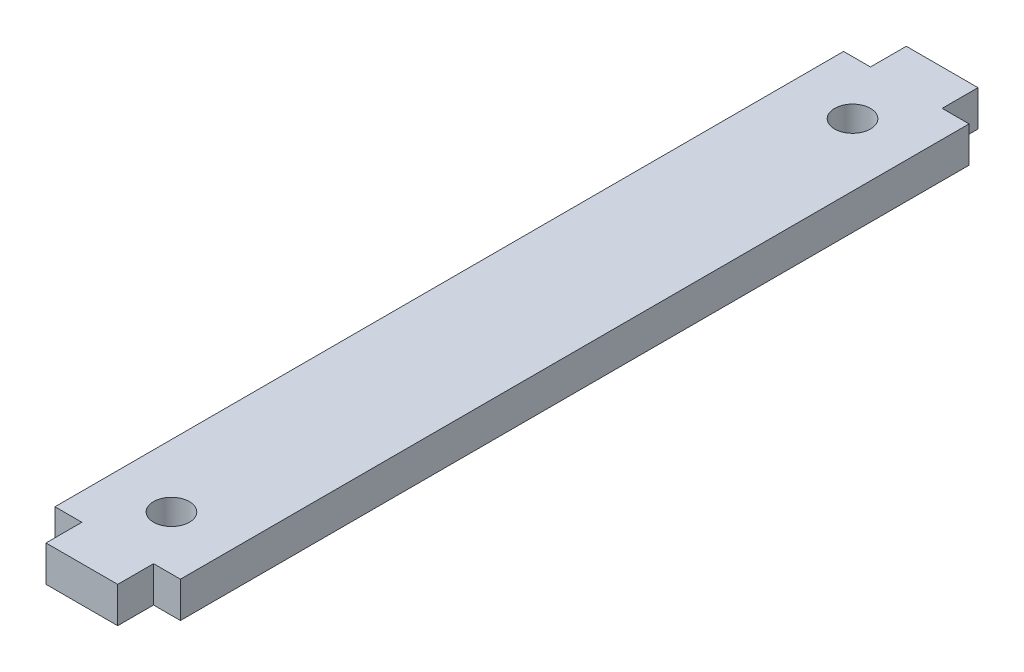
ISO-10303-21;
HEADER;
FILE_DESCRIPTION(('STEP AP214'),'2;1');
FILE_NAME('part.step','',(''),(''),'','','');
FILE_SCHEMA(('AUTOMOTIVE_DESIGN { 1 0 10303 214 1 1 1 1 }'));
ENDSEC;
DATA;
#1=APPLICATION_CONTEXT('core data for automotive mechanical design processes');
#2=APPLICATION_PROTOCOL_DEFINITION('international standard','automotive_design',2000,#1);
#3=PRODUCT_CONTEXT('',#1,'mechanical');
#4=PRODUCT('Part','Part','',(#3));
#5=PRODUCT_RELATED_PRODUCT_CATEGORY('part','',(#4));
#6=PRODUCT_DEFINITION_FORMATION('','',#4);
#7=PRODUCT_DEFINITION_CONTEXT('part definition',#1,'design');
#8=PRODUCT_DEFINITION('design','',#6,#7);
#9=PRODUCT_DEFINITION_SHAPE('','',#8);
#10=(LENGTH_UNIT() NAMED_UNIT(*) SI_UNIT(.MILLI.,.METRE.));
#11=(NAMED_UNIT(*) PLANE_ANGLE_UNIT() SI_UNIT($,.RADIAN.));
#12=(NAMED_UNIT(*) SI_UNIT($,.STERADIAN.) SOLID_ANGLE_UNIT());
#13=UNCERTAINTY_MEASURE_WITH_UNIT(LENGTH_MEASURE(1.E-05),#10,'distance_accuracy_value','');
#14=(GEOMETRIC_REPRESENTATION_CONTEXT(3) GLOBAL_UNCERTAINTY_ASSIGNED_CONTEXT((#13)) GLOBAL_UNIT_ASSIGNED_CONTEXT((#10,
#11,#12)) REPRESENTATION_CONTEXT('',''));
#15=CARTESIAN_POINT('',(0.,0.,0.));
#16=DIRECTION('',(0.,0.,1.));
#17=DIRECTION('',(1.,0.,0.));
#18=AXIS2_PLACEMENT_3D('',#15,#16,#17);
#19=CARTESIAN_POINT('',(0.,5.08,-55.88));
#20=DIRECTION('',(0.,0.,1.));
#21=DIRECTION('',(1.,0.,0.));
#22=AXIS2_PLACEMENT_3D('',#19,#20,#21);
#23=PLANE('',#22);
#24=DIRECTION('',(-1.,0.,0.));
#25=VECTOR('',#24,1.);
#26=CARTESIAN_POINT('',(0.,0.,-55.88));
#27=LINE('',#26,#25);
#28=CARTESIAN_POINT('',(8.89000000000001,0.,-55.88));
#29=VERTEX_POINT('',#28);
#30=CARTESIAN_POINT('',(5.07999999999999,0.,-55.88));
#31=VERTEX_POINT('',#30);
#32=EDGE_CURVE('E219',#29,#31,#27,.T.);
#33=ORIENTED_EDGE('',*,*,#32,.T.);
#34=DIRECTION('',(0.,-1.,0.));
#35=VECTOR('',#34,1.);
#36=CARTESIAN_POINT('',(5.07999999999999,5.08,-55.88));
#37=LINE('',#36,#35);
#38=CARTESIAN_POINT('',(5.07999999999999,5.08,-55.88));
#39=VERTEX_POINT('',#38);
#40=EDGE_CURVE('E11',#39,#31,#37,.T.);
#41=ORIENTED_EDGE('',*,*,#40,.F.);
#42=DIRECTION('',(-1.,0.,0.));
#43=VECTOR('',#42,1.);
#44=CARTESIAN_POINT('',(0.,5.08,-55.88));
#45=LINE('',#44,#43);
#46=CARTESIAN_POINT('',(8.89000000000001,5.08,-55.88));
#47=VERTEX_POINT('',#46);
#48=EDGE_CURVE('E173',#47,#39,#45,.T.);
#49=ORIENTED_EDGE('',*,*,#48,.F.);
#50=DIRECTION('',(0.,-1.,0.));
#51=VECTOR('',#50,1.);
#52=CARTESIAN_POINT('',(8.89000000000001,5.08,-55.88));
#53=LINE('',#52,#51);
#54=EDGE_CURVE('E56',#47,#29,#53,.T.);
#55=ORIENTED_EDGE('',*,*,#54,.T.);
#56=EDGE_LOOP('',(#33,#41,#49,#55));
#57=FACE_BOUND('',#56,.T.);
#58=ADVANCED_FACE('F39',(#57),#23,.F.);
#59=CARTESIAN_POINT('',(5.07999999999999,5.08,0.));
#60=DIRECTION('',(-1.,0.,0.));
#61=DIRECTION('',(0.,0.,1.));
#62=AXIS2_PLACEMENT_3D('',#59,#60,#61);
#63=PLANE('',#62);
#64=DIRECTION('',(0.,0.,-1.));
#65=VECTOR('',#64,1.);
#66=CARTESIAN_POINT('',(5.07999999999999,0.,0.));
#67=LINE('',#66,#65);
#68=CARTESIAN_POINT('',(5.07999999999999,0.,-60.96));
#69=VERTEX_POINT('',#68);
#70=EDGE_CURVE('E217',#31,#69,#67,.T.);
#71=ORIENTED_EDGE('',*,*,#70,.T.);
#72=DIRECTION('',(0.,-1.,0.));
#73=VECTOR('',#72,1.);
#74=CARTESIAN_POINT('',(5.07999999999999,5.08,-60.96));
#75=LINE('',#74,#73);
#76=CARTESIAN_POINT('',(5.07999999999999,5.08,-60.96));
#77=VERTEX_POINT('',#76);
#78=EDGE_CURVE('E48',#77,#69,#75,.T.);
#79=ORIENTED_EDGE('',*,*,#78,.F.);
#80=DIRECTION('',(0.,0.,-1.));
#81=VECTOR('',#80,1.);
#82=CARTESIAN_POINT('',(5.07999999999999,5.08,0.));
#83=LINE('',#82,#81);
#84=EDGE_CURVE('E106',#39,#77,#83,.T.);
#85=ORIENTED_EDGE('',*,*,#84,.F.);
#86=ORIENTED_EDGE('',*,*,#40,.T.);
#87=EDGE_LOOP('',(#71,#79,#85,#86));
#88=FACE_BOUND('',#87,.T.);
#89=ADVANCED_FACE('F41',(#88),#63,.F.);
#90=CARTESIAN_POINT('',(0.,5.08,-60.96));
#91=DIRECTION('',(0.,0.,-1.));
#92=DIRECTION('',(-1.,0.,0.));
#93=AXIS2_PLACEMENT_3D('',#90,#91,#92);
#94=PLANE('',#93);
#95=DIRECTION('',(1.,0.,0.));
#96=VECTOR('',#95,1.);
#97=CARTESIAN_POINT('',(0.,0.,-60.96));
#98=LINE('',#97,#96);
#99=CARTESIAN_POINT('',(-5.08000000000001,0.,-60.96));
#100=VERTEX_POINT('',#99);
#101=EDGE_CURVE('E214',#100,#69,#98,.T.);
#102=ORIENTED_EDGE('',*,*,#101,.F.);
#103=DIRECTION('',(0.,-1.,0.));
#104=VECTOR('',#103,1.);
#105=CARTESIAN_POINT('',(-5.08000000000001,5.08,-60.96));
#106=LINE('',#105,#104);
#107=CARTESIAN_POINT('',(-5.08000000000001,5.08,-60.96));
#108=VERTEX_POINT('',#107);
#109=EDGE_CURVE('E208',#108,#100,#106,.T.);
#110=ORIENTED_EDGE('',*,*,#109,.F.);
#111=DIRECTION('',(1.,0.,0.));
#112=VECTOR('',#111,1.);
#113=CARTESIAN_POINT('',(0.,5.08,-60.96));
#114=LINE('',#113,#112);
#115=EDGE_CURVE('E177',#108,#77,#114,.T.);
#116=ORIENTED_EDGE('',*,*,#115,.T.);
#117=ORIENTED_EDGE('',*,*,#78,.T.);
#118=EDGE_LOOP('',(#102,#110,#116,#117));
#119=FACE_BOUND('',#118,.T.);
#120=ADVANCED_FACE('F212',(#119),#94,.T.);
#121=CARTESIAN_POINT('',(-5.07999999999997,5.08,0.));
#122=DIRECTION('',(-1.,0.,0.));
#123=DIRECTION('',(0.,0.,1.));
#124=AXIS2_PLACEMENT_3D('',#121,#122,#123);
#125=PLANE('',#124);
#126=DIRECTION('',(0.,0.,-1.));
#127=VECTOR('',#126,1.);
#128=CARTESIAN_POINT('',(-5.07999999999997,0.,0.));
#129=LINE('',#128,#127);
#130=CARTESIAN_POINT('',(-5.08000000000001,0.,-55.88));
#131=VERTEX_POINT('',#130);
#132=EDGE_CURVE('E225',#131,#100,#129,.T.);
#133=ORIENTED_EDGE('',*,*,#132,.F.);
#134=DIRECTION('',(0.,-1.,0.));
#135=VECTOR('',#134,1.);
#136=CARTESIAN_POINT('',(-5.08000000000001,5.08,-55.88));
#137=LINE('',#136,#135);
#138=CARTESIAN_POINT('',(-5.08000000000001,5.08,-55.88));
#139=VERTEX_POINT('',#138);
#140=EDGE_CURVE('E206',#139,#131,#137,.T.);
#141=ORIENTED_EDGE('',*,*,#140,.F.);
#142=DIRECTION('',(0.,0.,-1.));
#143=VECTOR('',#142,1.);
#144=CARTESIAN_POINT('',(-5.07999999999997,5.08,0.));
#145=LINE('',#144,#143);
#146=EDGE_CURVE('E171',#139,#108,#145,.T.);
#147=ORIENTED_EDGE('',*,*,#146,.T.);
#148=ORIENTED_EDGE('',*,*,#109,.T.);
#149=EDGE_LOOP('',(#133,#141,#147,#148));
#150=FACE_BOUND('',#149,.T.);
#151=ADVANCED_FACE('F285',(#150),#125,.T.);
#152=CARTESIAN_POINT('',(-8.88999999999999,0.,-55.88));
#153=VERTEX_POINT('',#152);
#154=EDGE_CURVE('E227',#131,#153,#27,.T.);
#155=ORIENTED_EDGE('',*,*,#154,.T.);
#156=DIRECTION('',(0.,-1.,0.));
#157=VECTOR('',#156,1.);
#158=CARTESIAN_POINT('',(-8.88999999999999,5.08,-55.88));
#159=LINE('',#158,#157);
#160=CARTESIAN_POINT('',(-8.88999999999999,5.08,-55.88));
#161=VERTEX_POINT('',#160);
#162=EDGE_CURVE('E203',#161,#153,#159,.T.);
#163=ORIENTED_EDGE('',*,*,#162,.F.);
#164=EDGE_CURVE('E168',#139,#161,#45,.T.);
#165=ORIENTED_EDGE('',*,*,#164,.F.);
#166=ORIENTED_EDGE('',*,*,#140,.T.);
#167=EDGE_LOOP('',(#155,#163,#165,#166));
#168=FACE_BOUND('',#167,.T.);
#169=ADVANCED_FACE('F260',(#168),#23,.F.);
#170=CARTESIAN_POINT('',(-8.88999999999999,5.08,0.));
#171=DIRECTION('',(1.,0.,0.));
#172=DIRECTION('',(0.,0.,-1.));
#173=AXIS2_PLACEMENT_3D('',#170,#171,#172);
#174=PLANE('',#173);
#175=DIRECTION('',(0.,0.,1.));
#176=VECTOR('',#175,1.);
#177=CARTESIAN_POINT('',(-8.88999999999999,0.,0.));
#178=LINE('',#177,#176);
#179=CARTESIAN_POINT('',(-8.88999999999999,0.,55.88));
#180=VERTEX_POINT('',#179);
#181=EDGE_CURVE('E231',#153,#180,#178,.T.);
#182=ORIENTED_EDGE('',*,*,#181,.T.);
#183=DIRECTION('',(0.,-1.,0.));
#184=VECTOR('',#183,1.);
#185=CARTESIAN_POINT('',(-8.88999999999999,5.08,55.88));
#186=LINE('',#185,#184);
#187=CARTESIAN_POINT('',(-8.88999999999999,5.08,55.88));
#188=VERTEX_POINT('',#187);
#189=EDGE_CURVE('E201',#188,#180,#186,.T.);
#190=ORIENTED_EDGE('',*,*,#189,.F.);
#191=DIRECTION('',(0.,0.,1.));
#192=VECTOR('',#191,1.);
#193=CARTESIAN_POINT('',(-8.88999999999999,5.08,0.));
#194=LINE('',#193,#192);
#195=EDGE_CURVE('E165',#161,#188,#194,.T.);
#196=ORIENTED_EDGE('',*,*,#195,.F.);
#197=ORIENTED_EDGE('',*,*,#162,.T.);
#198=EDGE_LOOP('',(#182,#190,#196,#197));
#199=FACE_BOUND('',#198,.T.);
#200=ADVANCED_FACE('F256',(#199),#174,.F.);
#201=CARTESIAN_POINT('',(0.,5.08,55.88));
#202=DIRECTION('',(0.,0.,1.));
#203=DIRECTION('',(1.,0.,0.));
#204=AXIS2_PLACEMENT_3D('',#201,#202,#203);
#205=PLANE('',#204);
#206=DIRECTION('',(-1.,0.,0.));
#207=VECTOR('',#206,1.);
#208=CARTESIAN_POINT('',(0.,0.,55.88));
#209=LINE('',#208,#207);
#210=CARTESIAN_POINT('',(-5.08000000000001,0.,55.88));
#211=VERTEX_POINT('',#210);
#212=EDGE_CURVE('E234',#211,#180,#209,.T.);
#213=ORIENTED_EDGE('',*,*,#212,.F.);
#214=DIRECTION('',(0.,-1.,0.));
#215=VECTOR('',#214,1.);
#216=CARTESIAN_POINT('',(-5.08000000000001,5.08,55.88));
#217=LINE('',#216,#215);
#218=CARTESIAN_POINT('',(-5.08000000000001,5.08,55.88));
#219=VERTEX_POINT('',#218);
#220=EDGE_CURVE('E199',#219,#211,#217,.T.);
#221=ORIENTED_EDGE('',*,*,#220,.F.);
#222=DIRECTION('',(-1.,0.,0.));
#223=VECTOR('',#222,1.);
#224=CARTESIAN_POINT('',(0.,5.08,55.88));
#225=LINE('',#224,#223);
#226=EDGE_CURVE('E158',#219,#188,#225,.T.);
#227=ORIENTED_EDGE('',*,*,#226,.T.);
#228=ORIENTED_EDGE('',*,*,#189,.T.);
#229=EDGE_LOOP('',(#213,#221,#227,#228));
#230=FACE_BOUND('',#229,.T.);
#231=ADVANCED_FACE('F253',(#230),#205,.T.);
#232=CARTESIAN_POINT('',(-5.07999999999997,5.08,0.));
#233=DIRECTION('',(1.,0.,0.));
#234=DIRECTION('',(0.,0.,-1.));
#235=AXIS2_PLACEMENT_3D('',#232,#233,#234);
#236=PLANE('',#235);
#237=DIRECTION('',(0.,0.,1.));
#238=VECTOR('',#237,1.);
#239=CARTESIAN_POINT('',(-5.07999999999997,0.,0.));
#240=LINE('',#239,#238);
#241=CARTESIAN_POINT('',(-5.08000000000001,0.,60.96));
#242=VERTEX_POINT('',#241);
#243=EDGE_CURVE('E237',#211,#242,#240,.T.);
#244=ORIENTED_EDGE('',*,*,#243,.T.);
#245=DIRECTION('',(0.,-1.,0.));
#246=VECTOR('',#245,1.);
#247=CARTESIAN_POINT('',(-5.08000000000001,5.08,60.96));
#248=LINE('',#247,#246);
#249=CARTESIAN_POINT('',(-5.08000000000001,5.08,60.96));
#250=VERTEX_POINT('',#249);
#251=EDGE_CURVE('E196',#250,#242,#248,.T.);
#252=ORIENTED_EDGE('',*,*,#251,.F.);
#253=DIRECTION('',(0.,0.,1.));
#254=VECTOR('',#253,1.);
#255=CARTESIAN_POINT('',(-5.07999999999997,5.08,0.));
#256=LINE('',#255,#254);
#257=EDGE_CURVE('E164',#219,#250,#256,.T.);
#258=ORIENTED_EDGE('',*,*,#257,.F.);
#259=ORIENTED_EDGE('',*,*,#220,.T.);
#260=EDGE_LOOP('',(#244,#252,#258,#259));
#261=FACE_BOUND('',#260,.T.);
#262=ADVANCED_FACE('F252',(#261),#236,.F.);
#263=CARTESIAN_POINT('',(0.,5.08,60.96));
#264=DIRECTION('',(0.,0.,-1.));
#265=DIRECTION('',(-1.,0.,0.));
#266=AXIS2_PLACEMENT_3D('',#263,#264,#265);
#267=PLANE('',#266);
#268=DIRECTION('',(1.,0.,0.));
#269=VECTOR('',#268,1.);
#270=CARTESIAN_POINT('',(0.,0.,60.96));
#271=LINE('',#270,#269);
#272=CARTESIAN_POINT('',(5.07999999999999,0.,60.96));
#273=VERTEX_POINT('',#272);
#274=EDGE_CURVE('E240',#242,#273,#271,.T.);
#275=ORIENTED_EDGE('',*,*,#274,.T.);
#276=DIRECTION('',(0.,-1.,0.));
#277=VECTOR('',#276,1.);
#278=CARTESIAN_POINT('',(5.07999999999999,5.08,60.96));
#279=LINE('',#278,#277);
#280=CARTESIAN_POINT('',(5.07999999999999,5.08,60.96));
#281=VERTEX_POINT('',#280);
#282=EDGE_CURVE('E143',#281,#273,#279,.T.);
#283=ORIENTED_EDGE('',*,*,#282,.F.);
#284=DIRECTION('',(1.,0.,0.));
#285=VECTOR('',#284,1.);
#286=CARTESIAN_POINT('',(0.,5.08,60.96));
#287=LINE('',#286,#285);
#288=EDGE_CURVE('E152',#250,#281,#287,.T.);
#289=ORIENTED_EDGE('',*,*,#288,.F.);
#290=ORIENTED_EDGE('',*,*,#251,.T.);
#291=EDGE_LOOP('',(#275,#283,#289,#290));
#292=FACE_BOUND('',#291,.T.);
#293=ADVANCED_FACE('F248',(#292),#267,.F.);
#294=CARTESIAN_POINT('',(5.07999999999999,5.08,0.));
#295=DIRECTION('',(1.,0.,0.));
#296=DIRECTION('',(0.,0.,-1.));
#297=AXIS2_PLACEMENT_3D('',#294,#295,#296);
#298=PLANE('',#297);
#299=DIRECTION('',(0.,0.,1.));
#300=VECTOR('',#299,1.);
#301=CARTESIAN_POINT('',(5.07999999999999,0.,0.));
#302=LINE('',#301,#300);
#303=CARTESIAN_POINT('',(5.07999999999999,0.,55.88));
#304=VERTEX_POINT('',#303);
#305=EDGE_CURVE('E139',#304,#273,#302,.T.);
#306=ORIENTED_EDGE('',*,*,#305,.F.);
#307=DIRECTION('',(0.,-1.,0.));
#308=VECTOR('',#307,1.);
#309=CARTESIAN_POINT('',(5.07999999999999,5.08,55.88));
#310=LINE('',#309,#308);
#311=CARTESIAN_POINT('',(5.07999999999999,5.08,55.88));
#312=VERTEX_POINT('',#311);
#313=EDGE_CURVE('E134',#312,#304,#310,.T.);
#314=ORIENTED_EDGE('',*,*,#313,.F.);
#315=DIRECTION('',(0.,0.,1.));
#316=VECTOR('',#315,1.);
#317=CARTESIAN_POINT('',(5.07999999999999,5.08,0.));
#318=LINE('',#317,#316);
#319=EDGE_CURVE('E137',#312,#281,#318,.T.);
#320=ORIENTED_EDGE('',*,*,#319,.T.);
#321=ORIENTED_EDGE('',*,*,#282,.T.);
#322=EDGE_LOOP('',(#306,#314,#320,#321));
#323=FACE_BOUND('',#322,.T.);
#324=ADVANCED_FACE('F136',(#323),#298,.T.);
#325=CARTESIAN_POINT('',(8.89000000000001,0.,55.88));
#326=VERTEX_POINT('',#325);
#327=EDGE_CURVE('E238',#326,#304,#209,.T.);
#328=ORIENTED_EDGE('',*,*,#327,.F.);
#329=DIRECTION('',(0.,-1.,0.));
#330=VECTOR('',#329,1.);
#331=CARTESIAN_POINT('',(8.89000000000001,5.08,55.88));
#332=LINE('',#331,#330);
#333=CARTESIAN_POINT('',(8.89000000000001,5.08,55.88));
#334=VERTEX_POINT('',#333);
#335=EDGE_CURVE('E94',#334,#326,#332,.T.);
#336=ORIENTED_EDGE('',*,*,#335,.F.);
#337=EDGE_CURVE('E150',#334,#312,#225,.T.);
#338=ORIENTED_EDGE('',*,*,#337,.T.);
#339=ORIENTED_EDGE('',*,*,#313,.T.);
#340=EDGE_LOOP('',(#328,#336,#338,#339));
#341=FACE_BOUND('',#340,.T.);
#342=ADVANCED_FACE('F155',(#341),#205,.T.);
#343=CARTESIAN_POINT('',(0.,5.08,-48.26));
#344=DIRECTION('',(0.,-1.,0.));
#345=DIRECTION('',(0.,0.,-1.));
#346=AXIS2_PLACEMENT_3D('',#343,#344,#345);
#347=CYLINDRICAL_SURFACE('',#346,2.54);
#348=CARTESIAN_POINT('',(0.,5.08,-48.26));
#349=DIRECTION('',(0.,1.,0.));
#350=DIRECTION('',(0.,0.,1.));
#351=AXIS2_PLACEMENT_3D('',#348,#349,#350);
#352=CIRCLE('',#351,2.54);
#353=CARTESIAN_POINT('',(0.,5.08,-45.72));
#354=VERTEX_POINT('',#353);
#355=EDGE_CURVE('E159',#354,#354,#352,.T.);
#356=ORIENTED_EDGE('',*,*,#355,.T.);
#357=EDGE_LOOP('',(#356));
#358=FACE_BOUND('',#357,.T.);
#359=CARTESIAN_POINT('',(0.,0.,-48.26));
#360=DIRECTION('',(0.,1.,0.));
#361=DIRECTION('',(0.,0.,1.));
#362=AXIS2_PLACEMENT_3D('',#359,#360,#361);
#363=CIRCLE('',#362,2.54);
#364=CARTESIAN_POINT('',(0.,0.,-45.72));
#365=VERTEX_POINT('',#364);
#366=EDGE_CURVE('E183',#365,#365,#363,.T.);
#367=ORIENTED_EDGE('',*,*,#366,.F.);
#368=EDGE_LOOP('',(#367));
#369=FACE_BOUND('',#368,.T.);
#370=ADVANCED_FACE('F266',(#358,#369),#347,.F.);
#371=CARTESIAN_POINT('',(8.89000000000001,5.08,0.));
#372=DIRECTION('',(1.,0.,0.));
#373=DIRECTION('',(0.,0.,-1.));
#374=AXIS2_PLACEMENT_3D('',#371,#372,#373);
#375=PLANE('',#374);
#376=DIRECTION('',(0.,0.,1.));
#377=VECTOR('',#376,1.);
#378=CARTESIAN_POINT('',(8.89000000000001,0.,0.));
#379=LINE('',#378,#377);
#380=EDGE_CURVE('E188',#29,#326,#379,.T.);
#381=ORIENTED_EDGE('',*,*,#380,.F.);
#382=ORIENTED_EDGE('',*,*,#54,.F.);
#383=DIRECTION('',(0.,0.,1.));
#384=VECTOR('',#383,1.);
#385=CARTESIAN_POINT('',(8.89000000000001,5.08,0.));
#386=LINE('',#385,#384);
#387=EDGE_CURVE('E156',#47,#334,#386,.T.);
#388=ORIENTED_EDGE('',*,*,#387,.T.);
#389=ORIENTED_EDGE('',*,*,#335,.T.);
#390=EDGE_LOOP('',(#381,#382,#388,#389));
#391=FACE_BOUND('',#390,.T.);
#392=ADVANCED_FACE('F263',(#391),#375,.T.);
#393=CARTESIAN_POINT('',(0.,5.08,48.26));
#394=DIRECTION('',(0.,-1.,0.));
#395=DIRECTION('',(0.,0.,-1.));
#396=AXIS2_PLACEMENT_3D('',#393,#394,#395);
#397=CYLINDRICAL_SURFACE('',#396,2.54);
#398=CARTESIAN_POINT('',(0.,5.08,48.26));
#399=DIRECTION('',(0.,1.,0.));
#400=DIRECTION('',(0.,0.,1.));
#401=AXIS2_PLACEMENT_3D('',#398,#399,#400);
#402=CIRCLE('',#401,2.54);
#403=CARTESIAN_POINT('',(0.,5.08,50.8));
#404=VERTEX_POINT('',#403);
#405=EDGE_CURVE('E193',#404,#404,#402,.F.);
#406=ORIENTED_EDGE('',*,*,#405,.F.);
#407=EDGE_LOOP('',(#406));
#408=FACE_BOUND('',#407,.T.);
#409=CARTESIAN_POINT('',(0.,0.,48.26));
#410=DIRECTION('',(0.,1.,0.));
#411=DIRECTION('',(0.,0.,1.));
#412=AXIS2_PLACEMENT_3D('',#409,#410,#411);
#413=CIRCLE('',#412,2.54);
#414=CARTESIAN_POINT('',(0.,0.,50.8));
#415=VERTEX_POINT('',#414);
#416=EDGE_CURVE('E180',#415,#415,#413,.F.);
#417=ORIENTED_EDGE('',*,*,#416,.T.);
#418=EDGE_LOOP('',(#417));
#419=FACE_BOUND('',#418,.T.);
#420=ADVANCED_FACE('F265',(#408,#419),#397,.F.);
#421=CARTESIAN_POINT('',(0.,5.08,0.));
#422=DIRECTION('',(0.,1.,0.));
#423=DIRECTION('',(0.,0.,1.));
#424=AXIS2_PLACEMENT_3D('',#421,#422,#423);
#425=PLANE('',#424);
#426=ORIENTED_EDGE('',*,*,#48,.T.);
#427=ORIENTED_EDGE('',*,*,#84,.T.);
#428=ORIENTED_EDGE('',*,*,#115,.F.);
#429=ORIENTED_EDGE('',*,*,#146,.F.);
#430=ORIENTED_EDGE('',*,*,#164,.T.);
#431=ORIENTED_EDGE('',*,*,#195,.T.);
#432=ORIENTED_EDGE('',*,*,#226,.F.);
#433=ORIENTED_EDGE('',*,*,#257,.T.);
#434=ORIENTED_EDGE('',*,*,#288,.T.);
#435=ORIENTED_EDGE('',*,*,#319,.F.);
#436=ORIENTED_EDGE('',*,*,#337,.F.);
#437=ORIENTED_EDGE('',*,*,#387,.F.);
#438=EDGE_LOOP('',(#426,#427,#428,#429,#430,#431,#432,#433,#434,#435,#436,#437));
#439=FACE_BOUND('',#438,.T.);
#440=ORIENTED_EDGE('',*,*,#355,.F.);
#441=EDGE_LOOP('',(#440));
#442=FACE_BOUND('',#441,.T.);
#443=ORIENTED_EDGE('',*,*,#405,.T.);
#444=EDGE_LOOP('',(#443));
#445=FACE_BOUND('',#444,.T.);
#446=ADVANCED_FACE('F147',(#439,#442,#445),#425,.T.);
#447=CARTESIAN_POINT('',(0.,0.,0.));
#448=DIRECTION('',(0.,1.,0.));
#449=DIRECTION('',(0.,0.,1.));
#450=AXIS2_PLACEMENT_3D('',#447,#448,#449);
#451=PLANE('',#450);
#452=ORIENTED_EDGE('',*,*,#32,.F.);
#453=ORIENTED_EDGE('',*,*,#380,.T.);
#454=ORIENTED_EDGE('',*,*,#327,.T.);
#455=ORIENTED_EDGE('',*,*,#305,.T.);
#456=ORIENTED_EDGE('',*,*,#274,.F.);
#457=ORIENTED_EDGE('',*,*,#243,.F.);
#458=ORIENTED_EDGE('',*,*,#212,.T.);
#459=ORIENTED_EDGE('',*,*,#181,.F.);
#460=ORIENTED_EDGE('',*,*,#154,.F.);
#461=ORIENTED_EDGE('',*,*,#132,.T.);
#462=ORIENTED_EDGE('',*,*,#101,.T.);
#463=ORIENTED_EDGE('',*,*,#70,.F.);
#464=EDGE_LOOP('',(#452,#453,#454,#455,#456,#457,#458,#459,#460,#461,#462,#463));
#465=FACE_BOUND('',#464,.T.);
#466=ORIENTED_EDGE('',*,*,#366,.T.);
#467=EDGE_LOOP('',(#466));
#468=FACE_BOUND('',#467,.T.);
#469=ORIENTED_EDGE('',*,*,#416,.F.);
#470=EDGE_LOOP('',(#469));
#471=FACE_BOUND('',#470,.T.);
#472=ADVANCED_FACE('F221',(#465,#468,#471),#451,.F.);
#473=CLOSED_SHELL('',(#58,#89,#120,#151,#169,#200,#231,#262,#293,#324,#342,#370,#392,#420,#446,#472));
#474=MANIFOLD_SOLID_BREP('B2',#473);
#475=ADVANCED_BREP_SHAPE_REPRESENTATION('',(#18,#474),#14);
#476=SHAPE_DEFINITION_REPRESENTATION(#9,#475);
ENDSEC;
END-ISO-10303-21;
